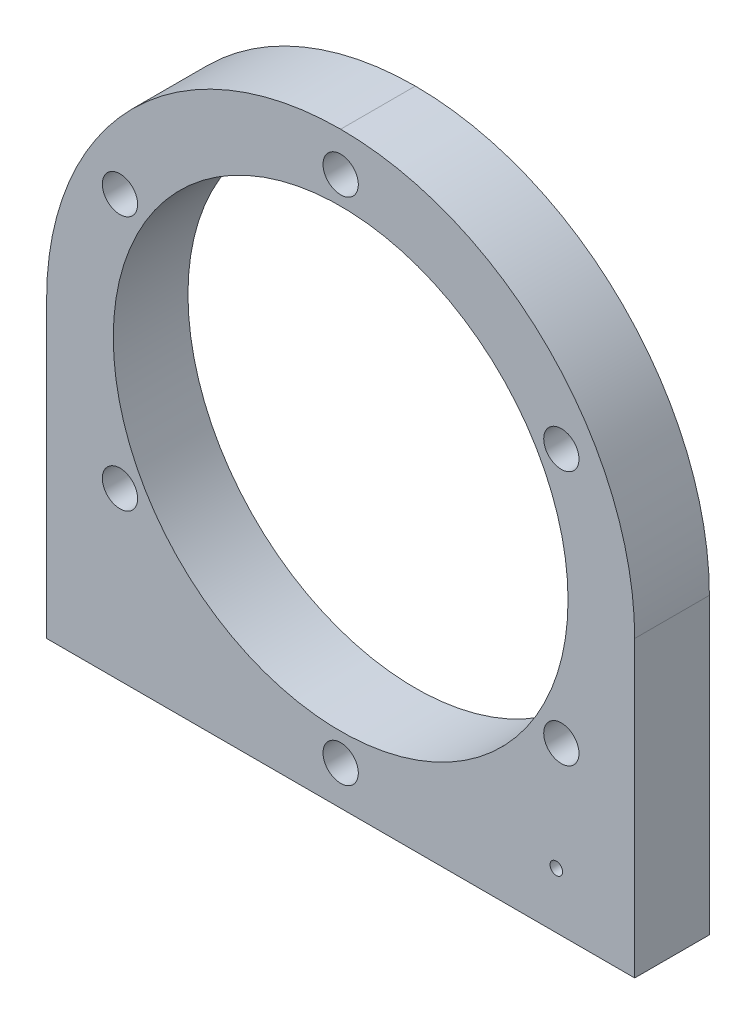
ISO-10303-21;
HEADER;
FILE_DESCRIPTION(('STEP AP214'),'2;1');
FILE_NAME('part.step','',(''),(''),'','','');
FILE_SCHEMA(('AUTOMOTIVE_DESIGN { 1 0 10303 214 1 1 1 1 }'));
ENDSEC;
DATA;
#1=APPLICATION_CONTEXT('core data for automotive mechanical design processes');
#2=APPLICATION_PROTOCOL_DEFINITION('international standard','automotive_design',2000,#1);
#3=PRODUCT_CONTEXT('',#1,'mechanical');
#4=PRODUCT('Part','Part','',(#3));
#5=PRODUCT_RELATED_PRODUCT_CATEGORY('part','',(#4));
#6=PRODUCT_DEFINITION_FORMATION('','',#4);
#7=PRODUCT_DEFINITION_CONTEXT('part definition',#1,'design');
#8=PRODUCT_DEFINITION('design','',#6,#7);
#9=PRODUCT_DEFINITION_SHAPE('','',#8);
#10=(LENGTH_UNIT() NAMED_UNIT(*) SI_UNIT(.MILLI.,.METRE.));
#11=(NAMED_UNIT(*) PLANE_ANGLE_UNIT() SI_UNIT($,.RADIAN.));
#12=(NAMED_UNIT(*) SI_UNIT($,.STERADIAN.) SOLID_ANGLE_UNIT());
#13=UNCERTAINTY_MEASURE_WITH_UNIT(LENGTH_MEASURE(1.E-05),#10,'distance_accuracy_value','');
#14=(GEOMETRIC_REPRESENTATION_CONTEXT(3) GLOBAL_UNCERTAINTY_ASSIGNED_CONTEXT((#13)) GLOBAL_UNIT_ASSIGNED_CONTEXT((#10,
#11,#12)) REPRESENTATION_CONTEXT('',''));
#15=CARTESIAN_POINT('',(0.,0.,0.));
#16=DIRECTION('',(0.,0.,1.));
#17=DIRECTION('',(1.,0.,0.));
#18=AXIS2_PLACEMENT_3D('',#15,#16,#17);
#19=CARTESIAN_POINT('',(-37.5,-37.5,4.7625));
#20=DIRECTION('',(1.,0.,0.));
#21=DIRECTION('',(0.,0.,-1.));
#22=AXIS2_PLACEMENT_3D('',#19,#20,#21);
#23=PLANE('',#22);
#24=DIRECTION('',(0.,-1.,0.));
#25=VECTOR('',#24,1.);
#26=CARTESIAN_POINT('',(-37.5,-37.5,4.7625));
#27=LINE('',#26,#25);
#28=CARTESIAN_POINT('',(-37.5,0.,4.7625));
#29=VERTEX_POINT('',#28);
#30=CARTESIAN_POINT('',(-37.5,-37.5,4.7625));
#31=VERTEX_POINT('',#30);
#32=EDGE_CURVE('E145',#29,#31,#27,.T.);
#33=ORIENTED_EDGE('',*,*,#32,.F.);
#34=DIRECTION('',(0.,0.,-1.));
#35=VECTOR('',#34,1.);
#36=CARTESIAN_POINT('',(-37.5,0.,4.7625));
#37=LINE('',#36,#35);
#38=CARTESIAN_POINT('',(-37.5,0.,-4.7625));
#39=VERTEX_POINT('',#38);
#40=EDGE_CURVE('E162',#29,#39,#37,.T.);
#41=ORIENTED_EDGE('',*,*,#40,.T.);
#42=DIRECTION('',(0.,-1.,0.));
#43=VECTOR('',#42,1.);
#44=CARTESIAN_POINT('',(-37.5,-37.5,-4.7625));
#45=LINE('',#44,#43);
#46=CARTESIAN_POINT('',(-37.5,-37.5,-4.7625));
#47=VERTEX_POINT('',#46);
#48=EDGE_CURVE('E144',#39,#47,#45,.T.);
#49=ORIENTED_EDGE('',*,*,#48,.T.);
#50=DIRECTION('',(0.,0.,-1.));
#51=VECTOR('',#50,1.);
#52=CARTESIAN_POINT('',(-37.5,-37.5,4.7625));
#53=LINE('',#52,#51);
#54=EDGE_CURVE('E159',#31,#47,#53,.T.);
#55=ORIENTED_EDGE('',*,*,#54,.F.);
#56=EDGE_LOOP('',(#33,#41,#49,#55));
#57=FACE_BOUND('',#56,.T.);
#58=ADVANCED_FACE('F51',(#57),#23,.F.);
#59=CARTESIAN_POINT('',(37.5,-37.5,4.7625));
#60=DIRECTION('',(0.,1.,0.));
#61=DIRECTION('',(-1.,0.,0.));
#62=AXIS2_PLACEMENT_3D('',#59,#60,#61);
#63=PLANE('',#62);
#64=CARTESIAN_POINT('',(32.5,-37.5,0.));
#65=DIRECTION('',(0.,-1.,0.));
#66=DIRECTION('',(0.,0.,-1.));
#67=AXIS2_PLACEMENT_3D('',#64,#65,#66);
#68=CIRCLE('',#67,1.64999999999999);
#69=CARTESIAN_POINT('',(32.5,-37.5,-1.65));
#70=VERTEX_POINT('',#69);
#71=EDGE_CURVE('E120',#70,#70,#68,.T.);
#72=ORIENTED_EDGE('',*,*,#71,.F.);
#73=EDGE_LOOP('',(#72));
#74=FACE_BOUND('',#73,.T.);
#75=CARTESIAN_POINT('',(22.5,-37.5,0.));
#76=DIRECTION('',(0.,-1.,0.));
#77=DIRECTION('',(0.,0.,-1.));
#78=AXIS2_PLACEMENT_3D('',#75,#76,#77);
#79=CIRCLE('',#78,1.64999999999999);
#80=CARTESIAN_POINT('',(22.5,-37.5,-1.64999999999999));
#81=VERTEX_POINT('',#80);
#82=EDGE_CURVE('E119',#81,#81,#79,.T.);
#83=ORIENTED_EDGE('',*,*,#82,.F.);
#84=EDGE_LOOP('',(#83));
#85=FACE_BOUND('',#84,.T.);
#86=CARTESIAN_POINT('',(-22.5,-37.5,0.));
#87=DIRECTION('',(0.,-1.,0.));
#88=DIRECTION('',(0.,0.,-1.));
#89=AXIS2_PLACEMENT_3D('',#86,#87,#88);
#90=CIRCLE('',#89,1.64999999999999);
#91=CARTESIAN_POINT('',(-22.5,-37.5,-1.64999999999999));
#92=VERTEX_POINT('',#91);
#93=EDGE_CURVE('E132',#92,#92,#90,.T.);
#94=ORIENTED_EDGE('',*,*,#93,.F.);
#95=EDGE_LOOP('',(#94));
#96=FACE_BOUND('',#95,.T.);
#97=CARTESIAN_POINT('',(-32.5,-37.5,0.));
#98=DIRECTION('',(0.,-1.,0.));
#99=DIRECTION('',(0.,0.,-1.));
#100=AXIS2_PLACEMENT_3D('',#97,#98,#99);
#101=CIRCLE('',#100,1.64999999999999);
#102=CARTESIAN_POINT('',(-32.5,-37.5,-1.64999999999999));
#103=VERTEX_POINT('',#102);
#104=EDGE_CURVE('E138',#103,#103,#101,.T.);
#105=ORIENTED_EDGE('',*,*,#104,.F.);
#106=EDGE_LOOP('',(#105));
#107=FACE_BOUND('',#106,.T.);
#108=DIRECTION('',(1.,0.,0.));
#109=VECTOR('',#108,1.);
#110=CARTESIAN_POINT('',(37.5,-37.5,-4.7625));
#111=LINE('',#110,#109);
#112=CARTESIAN_POINT('',(37.5,-37.5,-4.7625));
#113=VERTEX_POINT('',#112);
#114=EDGE_CURVE('E154',#47,#113,#111,.T.);
#115=ORIENTED_EDGE('',*,*,#114,.T.);
#116=DIRECTION('',(0.,0.,-1.));
#117=VECTOR('',#116,1.);
#118=CARTESIAN_POINT('',(37.5,-37.5,4.7625));
#119=LINE('',#118,#117);
#120=CARTESIAN_POINT('',(37.5,-37.5,4.7625));
#121=VERTEX_POINT('',#120);
#122=EDGE_CURVE('E152',#121,#113,#119,.T.);
#123=ORIENTED_EDGE('',*,*,#122,.F.);
#124=DIRECTION('',(1.,0.,0.));
#125=VECTOR('',#124,1.);
#126=CARTESIAN_POINT('',(37.5,-37.5,4.7625));
#127=LINE('',#126,#125);
#128=EDGE_CURVE('E147',#31,#121,#127,.T.);
#129=ORIENTED_EDGE('',*,*,#128,.F.);
#130=ORIENTED_EDGE('',*,*,#54,.T.);
#131=EDGE_LOOP('',(#115,#123,#129,#130));
#132=FACE_BOUND('',#131,.T.);
#133=ADVANCED_FACE('F250',(#74,#85,#96,#107,#132),#63,.F.);
#134=CARTESIAN_POINT('',(37.5,-37.5,4.7625));
#135=DIRECTION('',(-1.,0.,0.));
#136=DIRECTION('',(0.,0.,1.));
#137=AXIS2_PLACEMENT_3D('',#134,#135,#136);
#138=PLANE('',#137);
#139=DIRECTION('',(0.,1.,0.));
#140=VECTOR('',#139,1.);
#141=CARTESIAN_POINT('',(37.5,-37.5,-4.7625));
#142=LINE('',#141,#140);
#143=CARTESIAN_POINT('',(37.5,0.,-4.7625));
#144=VERTEX_POINT('',#143);
#145=EDGE_CURVE('E148',#113,#144,#142,.T.);
#146=ORIENTED_EDGE('',*,*,#145,.T.);
#147=DIRECTION('',(0.,0.,-1.));
#148=VECTOR('',#147,1.);
#149=CARTESIAN_POINT('',(37.5,0.,4.7625));
#150=LINE('',#149,#148);
#151=CARTESIAN_POINT('',(37.5,0.,4.7625));
#152=VERTEX_POINT('',#151);
#153=EDGE_CURVE('E11',#144,#152,#150,.F.);
#154=ORIENTED_EDGE('',*,*,#153,.T.);
#155=DIRECTION('',(0.,1.,0.));
#156=VECTOR('',#155,1.);
#157=CARTESIAN_POINT('',(37.5,-37.5,4.7625));
#158=LINE('',#157,#156);
#159=EDGE_CURVE('E150',#121,#152,#158,.T.);
#160=ORIENTED_EDGE('',*,*,#159,.F.);
#161=ORIENTED_EDGE('',*,*,#122,.T.);
#162=EDGE_LOOP('',(#146,#154,#160,#161));
#163=FACE_BOUND('',#162,.T.);
#164=ADVANCED_FACE('F240',(#163),#138,.F.);
#165=CARTESIAN_POINT('',(0.,0.,4.7625));
#166=DIRECTION('',(0.,0.,1.));
#167=DIRECTION('',(1.,0.,0.));
#168=AXIS2_PLACEMENT_3D('',#165,#166,#167);
#169=PLANE('',#168);
#170=CARTESIAN_POINT('',(27.5,-30.38125,4.7625));
#171=DIRECTION('',(0.,0.,1.));
#172=DIRECTION('',(1.,0.,0.));
#173=AXIS2_PLACEMENT_3D('',#170,#171,#172);
#174=CIRCLE('',#173,0.799999999999988);
#175=CARTESIAN_POINT('',(28.3,-30.38125,4.7625));
#176=VERTEX_POINT('',#175);
#177=EDGE_CURVE('E193',#176,#176,#174,.T.);
#178=ORIENTED_EDGE('',*,*,#177,.F.);
#179=EDGE_LOOP('',(#178));
#180=FACE_BOUND('',#179,.T.);
#181=CARTESIAN_POINT('',(0.,32.5,4.7625));
#182=DIRECTION('',(0.,0.,-1.));
#183=DIRECTION('',(-1.,0.,0.));
#184=AXIS2_PLACEMENT_3D('',#181,#182,#183);
#185=CIRCLE('',#184,2.25);
#186=CARTESIAN_POINT('',(-2.25,32.5,4.7625));
#187=VERTEX_POINT('',#186);
#188=EDGE_CURVE('E190',#187,#187,#185,.T.);
#189=ORIENTED_EDGE('',*,*,#188,.T.);
#190=EDGE_LOOP('',(#189));
#191=FACE_BOUND('',#190,.T.);
#192=CARTESIAN_POINT('',(-28.1458256229944,16.2499999999998,4.7625));
#193=DIRECTION('',(0.,0.,-1.));
#194=DIRECTION('',(-1.,0.,0.));
#195=AXIS2_PLACEMENT_3D('',#192,#193,#194);
#196=CIRCLE('',#195,2.25);
#197=CARTESIAN_POINT('',(-30.3958256229944,16.2499999999998,4.7625));
#198=VERTEX_POINT('',#197);
#199=EDGE_CURVE('E205',#198,#198,#196,.T.);
#200=ORIENTED_EDGE('',*,*,#199,.T.);
#201=EDGE_LOOP('',(#200));
#202=FACE_BOUND('',#201,.T.);
#203=CARTESIAN_POINT('',(28.1458256229942,16.25,4.7625));
#204=DIRECTION('',(0.,0.,-1.));
#205=DIRECTION('',(-1.,0.,0.));
#206=AXIS2_PLACEMENT_3D('',#203,#204,#205);
#207=CIRCLE('',#206,2.25);
#208=CARTESIAN_POINT('',(25.8958256229942,16.25,4.7625));
#209=VERTEX_POINT('',#208);
#210=EDGE_CURVE('E211',#209,#209,#207,.T.);
#211=ORIENTED_EDGE('',*,*,#210,.T.);
#212=EDGE_LOOP('',(#211));
#213=FACE_BOUND('',#212,.T.);
#214=CARTESIAN_POINT('',(28.1458256229943,-16.25,4.7625));
#215=DIRECTION('',(0.,0.,-1.));
#216=DIRECTION('',(-1.,0.,0.));
#217=AXIS2_PLACEMENT_3D('',#214,#215,#216);
#218=CIRCLE('',#217,2.25);
#219=CARTESIAN_POINT('',(25.8958256229943,-16.25,4.7625));
#220=VERTEX_POINT('',#219);
#221=EDGE_CURVE('E217',#220,#220,#218,.T.);
#222=ORIENTED_EDGE('',*,*,#221,.T.);
#223=EDGE_LOOP('',(#222));
#224=FACE_BOUND('',#223,.T.);
#225=CARTESIAN_POINT('',(0.,-32.5,4.7625));
#226=DIRECTION('',(0.,0.,-1.));
#227=DIRECTION('',(-1.,0.,0.));
#228=AXIS2_PLACEMENT_3D('',#225,#226,#227);
#229=CIRCLE('',#228,2.25);
#230=CARTESIAN_POINT('',(-2.25,-32.5,4.7625));
#231=VERTEX_POINT('',#230);
#232=EDGE_CURVE('E223',#231,#231,#229,.T.);
#233=ORIENTED_EDGE('',*,*,#232,.T.);
#234=EDGE_LOOP('',(#233));
#235=FACE_BOUND('',#234,.T.);
#236=CARTESIAN_POINT('',(-28.1458256229941,-16.2500000000003,4.7625));
#237=DIRECTION('',(0.,0.,-1.));
#238=DIRECTION('',(-1.,0.,0.));
#239=AXIS2_PLACEMENT_3D('',#236,#237,#238);
#240=CIRCLE('',#239,2.25);
#241=CARTESIAN_POINT('',(-30.3958256229941,-16.2500000000003,4.7625));
#242=VERTEX_POINT('',#241);
#243=EDGE_CURVE('E229',#242,#242,#240,.T.);
#244=ORIENTED_EDGE('',*,*,#243,.T.);
#245=EDGE_LOOP('',(#244));
#246=FACE_BOUND('',#245,.T.);
#247=CARTESIAN_POINT('',(0.,0.,4.7625));
#248=DIRECTION('',(0.,0.,1.));
#249=DIRECTION('',(1.,0.,0.));
#250=AXIS2_PLACEMENT_3D('',#247,#248,#249);
#251=CIRCLE('',#250,29.);
#252=CARTESIAN_POINT('',(29.,0.,4.7625));
#253=VERTEX_POINT('',#252);
#254=EDGE_CURVE('E232',#253,#253,#251,.T.);
#255=ORIENTED_EDGE('',*,*,#254,.F.);
#256=EDGE_LOOP('',(#255));
#257=FACE_BOUND('',#256,.T.);
#258=CARTESIAN_POINT('',(0.,0.,4.7625));
#259=DIRECTION('',(0.,0.,1.));
#260=DIRECTION('',(1.,0.,0.));
#261=AXIS2_PLACEMENT_3D('',#258,#259,#260);
#262=CIRCLE('',#261,37.5);
#263=CARTESIAN_POINT('',(0.,37.5,4.7625));
#264=VERTEX_POINT('',#263);
#265=EDGE_CURVE('E67',#152,#264,#262,.T.);
#266=ORIENTED_EDGE('',*,*,#265,.T.);
#267=CARTESIAN_POINT('',(0.,0.,4.7625));
#268=DIRECTION('',(0.,0.,1.));
#269=DIRECTION('',(1.,0.,0.));
#270=AXIS2_PLACEMENT_3D('',#267,#268,#269);
#271=CIRCLE('',#270,37.5);
#272=EDGE_CURVE('E60',#264,#29,#271,.T.);
#273=ORIENTED_EDGE('',*,*,#272,.T.);
#274=ORIENTED_EDGE('',*,*,#32,.T.);
#275=ORIENTED_EDGE('',*,*,#128,.T.);
#276=ORIENTED_EDGE('',*,*,#159,.T.);
#277=EDGE_LOOP('',(#266,#273,#274,#275,#276));
#278=FACE_BOUND('',#277,.T.);
#279=ADVANCED_FACE('F172',(#180,#191,#202,#213,#224,#235,#246,#257,#278),#169,.T.);
#280=CARTESIAN_POINT('',(0.,0.,-4.7625));
#281=DIRECTION('',(0.,0.,1.));
#282=DIRECTION('',(1.,0.,0.));
#283=AXIS2_PLACEMENT_3D('',#280,#281,#282);
#284=PLANE('',#283);
#285=CARTESIAN_POINT('',(27.5,-30.38125,-4.7625));
#286=DIRECTION('',(0.,0.,1.));
#287=DIRECTION('',(1.,0.,0.));
#288=AXIS2_PLACEMENT_3D('',#285,#286,#287);
#289=CIRCLE('',#288,0.799999999999999);
#290=CARTESIAN_POINT('',(28.3,-30.38125,-4.7625));
#291=VERTEX_POINT('',#290);
#292=EDGE_CURVE('E188',#291,#291,#289,.T.);
#293=ORIENTED_EDGE('',*,*,#292,.T.);
#294=EDGE_LOOP('',(#293));
#295=FACE_BOUND('',#294,.T.);
#296=CARTESIAN_POINT('',(0.,32.5,-4.7625));
#297=DIRECTION('',(0.,0.,-1.));
#298=DIRECTION('',(-1.,0.,0.));
#299=AXIS2_PLACEMENT_3D('',#296,#297,#298);
#300=CIRCLE('',#299,2.24999999999999);
#301=CARTESIAN_POINT('',(-2.24999999999999,32.5,-4.7625));
#302=VERTEX_POINT('',#301);
#303=EDGE_CURVE('E187',#302,#302,#300,.T.);
#304=ORIENTED_EDGE('',*,*,#303,.F.);
#305=EDGE_LOOP('',(#304));
#306=FACE_BOUND('',#305,.T.);
#307=CARTESIAN_POINT('',(-28.1458256229944,16.2499999999998,-4.7625));
#308=DIRECTION('',(0.,0.,-1.));
#309=DIRECTION('',(-1.,0.,0.));
#310=AXIS2_PLACEMENT_3D('',#307,#308,#309);
#311=CIRCLE('',#310,2.24999999999999);
#312=CARTESIAN_POINT('',(-30.3958256229944,16.2499999999998,-4.7625));
#313=VERTEX_POINT('',#312);
#314=EDGE_CURVE('E202',#313,#313,#311,.T.);
#315=ORIENTED_EDGE('',*,*,#314,.F.);
#316=EDGE_LOOP('',(#315));
#317=FACE_BOUND('',#316,.T.);
#318=CARTESIAN_POINT('',(28.1458256229942,16.25,-4.7625));
#319=DIRECTION('',(0.,0.,-1.));
#320=DIRECTION('',(-1.,0.,0.));
#321=AXIS2_PLACEMENT_3D('',#318,#319,#320);
#322=CIRCLE('',#321,2.24999999999999);
#323=CARTESIAN_POINT('',(25.8958256229942,16.25,-4.7625));
#324=VERTEX_POINT('',#323);
#325=EDGE_CURVE('E208',#324,#324,#322,.T.);
#326=ORIENTED_EDGE('',*,*,#325,.F.);
#327=EDGE_LOOP('',(#326));
#328=FACE_BOUND('',#327,.T.);
#329=CARTESIAN_POINT('',(28.1458256229943,-16.25,-4.7625));
#330=DIRECTION('',(0.,0.,-1.));
#331=DIRECTION('',(-1.,0.,0.));
#332=AXIS2_PLACEMENT_3D('',#329,#330,#331);
#333=CIRCLE('',#332,2.24999999999999);
#334=CARTESIAN_POINT('',(25.8958256229943,-16.25,-4.7625));
#335=VERTEX_POINT('',#334);
#336=EDGE_CURVE('E214',#335,#335,#333,.T.);
#337=ORIENTED_EDGE('',*,*,#336,.F.);
#338=EDGE_LOOP('',(#337));
#339=FACE_BOUND('',#338,.T.);
#340=CARTESIAN_POINT('',(0.,-32.5,-4.7625));
#341=DIRECTION('',(0.,0.,-1.));
#342=DIRECTION('',(-1.,0.,0.));
#343=AXIS2_PLACEMENT_3D('',#340,#341,#342);
#344=CIRCLE('',#343,2.24999999999999);
#345=CARTESIAN_POINT('',(-2.24999999999999,-32.5,-4.7625));
#346=VERTEX_POINT('',#345);
#347=EDGE_CURVE('E220',#346,#346,#344,.T.);
#348=ORIENTED_EDGE('',*,*,#347,.F.);
#349=EDGE_LOOP('',(#348));
#350=FACE_BOUND('',#349,.T.);
#351=CARTESIAN_POINT('',(-28.1458256229941,-16.2500000000003,-4.7625));
#352=DIRECTION('',(0.,0.,-1.));
#353=DIRECTION('',(-1.,0.,0.));
#354=AXIS2_PLACEMENT_3D('',#351,#352,#353);
#355=CIRCLE('',#354,2.24999999999999);
#356=CARTESIAN_POINT('',(-30.395825622994,-16.2500000000003,-4.7625));
#357=VERTEX_POINT('',#356);
#358=EDGE_CURVE('E226',#357,#357,#355,.T.);
#359=ORIENTED_EDGE('',*,*,#358,.F.);
#360=EDGE_LOOP('',(#359));
#361=FACE_BOUND('',#360,.T.);
#362=CARTESIAN_POINT('',(0.,0.,-4.7625));
#363=DIRECTION('',(0.,0.,1.));
#364=DIRECTION('',(1.,0.,0.));
#365=AXIS2_PLACEMENT_3D('',#362,#363,#364);
#366=CIRCLE('',#365,29.);
#367=CARTESIAN_POINT('',(29.,0.,-4.7625));
#368=VERTEX_POINT('',#367);
#369=EDGE_CURVE('E126',#368,#368,#366,.T.);
#370=ORIENTED_EDGE('',*,*,#369,.T.);
#371=EDGE_LOOP('',(#370));
#372=FACE_BOUND('',#371,.T.);
#373=ORIENTED_EDGE('',*,*,#48,.F.);
#374=CARTESIAN_POINT('',(0.,0.,-4.7625));
#375=DIRECTION('',(0.,0.,1.));
#376=DIRECTION('',(1.,0.,0.));
#377=AXIS2_PLACEMENT_3D('',#374,#375,#376);
#378=CIRCLE('',#377,37.5);
#379=CARTESIAN_POINT('',(0.,37.5,-4.7625));
#380=VERTEX_POINT('',#379);
#381=EDGE_CURVE('E167',#39,#380,#378,.F.);
#382=ORIENTED_EDGE('',*,*,#381,.T.);
#383=CARTESIAN_POINT('',(0.,0.,-4.7625));
#384=DIRECTION('',(0.,0.,1.));
#385=DIRECTION('',(1.,0.,0.));
#386=AXIS2_PLACEMENT_3D('',#383,#384,#385);
#387=CIRCLE('',#386,37.5);
#388=EDGE_CURVE('E165',#380,#144,#387,.F.);
#389=ORIENTED_EDGE('',*,*,#388,.T.);
#390=ORIENTED_EDGE('',*,*,#145,.F.);
#391=ORIENTED_EDGE('',*,*,#114,.F.);
#392=EDGE_LOOP('',(#373,#382,#389,#390,#391));
#393=FACE_BOUND('',#392,.T.);
#394=ADVANCED_FACE('F183',(#295,#306,#317,#328,#339,#350,#361,#372,#393),#284,.F.);
#395=CARTESIAN_POINT('',(-32.5,-22.5,0.));
#396=DIRECTION('',(0.,-1.,0.));
#397=DIRECTION('',(0.,0.,-1.));
#398=AXIS2_PLACEMENT_3D('',#395,#396,#397);
#399=CONICAL_SURFACE('',#398,1.65,1.02974425867665);
#400=CARTESIAN_POINT('',(-32.5,-21.5085799786045,0.));
#401=VERTEX_POINT('',#400);
#402=VERTEX_LOOP('',#401);
#403=FACE_BOUND('',#402,.T.);
#404=CARTESIAN_POINT('',(-32.5,-22.5,0.));
#405=DIRECTION('',(0.,-1.,0.));
#406=DIRECTION('',(0.,0.,-1.));
#407=AXIS2_PLACEMENT_3D('',#404,#405,#406);
#408=CIRCLE('',#407,1.65);
#409=CARTESIAN_POINT('',(-32.5,-22.5,-1.64999999999999));
#410=VERTEX_POINT('',#409);
#411=EDGE_CURVE('E141',#410,#410,#408,.T.);
#412=ORIENTED_EDGE('',*,*,#411,.T.);
#413=EDGE_LOOP('',(#412));
#414=FACE_BOUND('',#413,.T.);
#415=ADVANCED_FACE('F247',(#403,#414),#399,.F.);
#416=CARTESIAN_POINT('',(-32.5,-37.5,0.));
#417=DIRECTION('',(0.,-1.,0.));
#418=DIRECTION('',(0.,0.,-1.));
#419=AXIS2_PLACEMENT_3D('',#416,#417,#418);
#420=CYLINDRICAL_SURFACE('',#419,1.64999999999999);
#421=ORIENTED_EDGE('',*,*,#411,.F.);
#422=EDGE_LOOP('',(#421));
#423=FACE_BOUND('',#422,.T.);
#424=ORIENTED_EDGE('',*,*,#104,.T.);
#425=EDGE_LOOP('',(#424));
#426=FACE_BOUND('',#425,.T.);
#427=ADVANCED_FACE('F320',(#423,#426),#420,.F.);
#428=CARTESIAN_POINT('',(-22.5,-22.5,0.));
#429=DIRECTION('',(0.,-1.,0.));
#430=DIRECTION('',(0.,0.,-1.));
#431=AXIS2_PLACEMENT_3D('',#428,#429,#430);
#432=CONICAL_SURFACE('',#431,1.65,1.02974425867665);
#433=CARTESIAN_POINT('',(-22.5,-21.5085799786045,0.));
#434=VERTEX_POINT('',#433);
#435=VERTEX_LOOP('',#434);
#436=FACE_BOUND('',#435,.T.);
#437=CARTESIAN_POINT('',(-22.5,-22.5,0.));
#438=DIRECTION('',(0.,-1.,0.));
#439=DIRECTION('',(0.,0.,-1.));
#440=AXIS2_PLACEMENT_3D('',#437,#438,#439);
#441=CIRCLE('',#440,1.65);
#442=CARTESIAN_POINT('',(-22.5,-22.5,-1.64999999999999));
#443=VERTEX_POINT('',#442);
#444=EDGE_CURVE('E135',#443,#443,#441,.T.);
#445=ORIENTED_EDGE('',*,*,#444,.T.);
#446=EDGE_LOOP('',(#445));
#447=FACE_BOUND('',#446,.T.);
#448=ADVANCED_FACE('F316',(#436,#447),#432,.F.);
#449=CARTESIAN_POINT('',(-22.5,-37.5,0.));
#450=DIRECTION('',(0.,-1.,0.));
#451=DIRECTION('',(0.,0.,-1.));
#452=AXIS2_PLACEMENT_3D('',#449,#450,#451);
#453=CYLINDRICAL_SURFACE('',#452,1.64999999999999);
#454=ORIENTED_EDGE('',*,*,#444,.F.);
#455=EDGE_LOOP('',(#454));
#456=FACE_BOUND('',#455,.T.);
#457=ORIENTED_EDGE('',*,*,#93,.T.);
#458=EDGE_LOOP('',(#457));
#459=FACE_BOUND('',#458,.T.);
#460=ADVANCED_FACE('F312',(#456,#459),#453,.F.);
#461=CARTESIAN_POINT('',(22.5,-22.5,0.));
#462=DIRECTION('',(0.,-1.,0.));
#463=DIRECTION('',(0.,0.,-1.));
#464=AXIS2_PLACEMENT_3D('',#461,#462,#463);
#465=CONICAL_SURFACE('',#464,1.65,1.02974425867665);
#466=CARTESIAN_POINT('',(22.5,-21.5085799786045,0.));
#467=VERTEX_POINT('',#466);
#468=VERTEX_LOOP('',#467);
#469=FACE_BOUND('',#468,.T.);
#470=CARTESIAN_POINT('',(22.5,-22.5,0.));
#471=DIRECTION('',(0.,-1.,0.));
#472=DIRECTION('',(0.,0.,-1.));
#473=AXIS2_PLACEMENT_3D('',#470,#471,#472);
#474=CIRCLE('',#473,1.65);
#475=CARTESIAN_POINT('',(22.5,-22.5,-1.65));
#476=VERTEX_POINT('',#475);
#477=EDGE_CURVE('E123',#476,#476,#474,.T.);
#478=ORIENTED_EDGE('',*,*,#477,.T.);
#479=EDGE_LOOP('',(#478));
#480=FACE_BOUND('',#479,.T.);
#481=ADVANCED_FACE('F308',(#469,#480),#465,.F.);
#482=CARTESIAN_POINT('',(22.5,-37.5,0.));
#483=DIRECTION('',(0.,-1.,0.));
#484=DIRECTION('',(0.,0.,-1.));
#485=AXIS2_PLACEMENT_3D('',#482,#483,#484);
#486=CYLINDRICAL_SURFACE('',#485,1.64999999999999);
#487=ORIENTED_EDGE('',*,*,#477,.F.);
#488=EDGE_LOOP('',(#487));
#489=FACE_BOUND('',#488,.T.);
#490=ORIENTED_EDGE('',*,*,#82,.T.);
#491=EDGE_LOOP('',(#490));
#492=FACE_BOUND('',#491,.T.);
#493=ADVANCED_FACE('F113',(#489,#492),#486,.F.);
#494=CARTESIAN_POINT('',(32.5,-22.5,0.));
#495=DIRECTION('',(0.,-1.,0.));
#496=DIRECTION('',(0.,0.,-1.));
#497=AXIS2_PLACEMENT_3D('',#494,#495,#496);
#498=CONICAL_SURFACE('',#497,1.65,1.02974425867665);
#499=CARTESIAN_POINT('',(32.5,-21.5085799786045,0.));
#500=VERTEX_POINT('',#499);
#501=VERTEX_LOOP('',#500);
#502=FACE_BOUND('',#501,.T.);
#503=CARTESIAN_POINT('',(32.5,-22.5,0.));
#504=DIRECTION('',(0.,-1.,0.));
#505=DIRECTION('',(0.,0.,-1.));
#506=AXIS2_PLACEMENT_3D('',#503,#504,#505);
#507=CIRCLE('',#506,1.65);
#508=CARTESIAN_POINT('',(32.5,-22.5,-1.65));
#509=VERTEX_POINT('',#508);
#510=EDGE_CURVE('E117',#509,#509,#507,.T.);
#511=ORIENTED_EDGE('',*,*,#510,.T.);
#512=EDGE_LOOP('',(#511));
#513=FACE_BOUND('',#512,.T.);
#514=ADVANCED_FACE('F109',(#502,#513),#498,.F.);
#515=CARTESIAN_POINT('',(32.5,-37.5,0.));
#516=DIRECTION('',(0.,-1.,0.));
#517=DIRECTION('',(0.,0.,-1.));
#518=AXIS2_PLACEMENT_3D('',#515,#516,#517);
#519=CYLINDRICAL_SURFACE('',#518,1.65);
#520=ORIENTED_EDGE('',*,*,#510,.F.);
#521=EDGE_LOOP('',(#520));
#522=FACE_BOUND('',#521,.T.);
#523=ORIENTED_EDGE('',*,*,#71,.T.);
#524=EDGE_LOOP('',(#523));
#525=FACE_BOUND('',#524,.T.);
#526=ADVANCED_FACE('F112',(#522,#525),#519,.F.);
#527=CARTESIAN_POINT('',(0.,0.,-4.7625));
#528=DIRECTION('',(0.,0.,1.));
#529=DIRECTION('',(1.,0.,0.));
#530=AXIS2_PLACEMENT_3D('',#527,#528,#529);
#531=CYLINDRICAL_SURFACE('',#530,29.);
#532=CARTESIAN_POINT('',(29.,0.,-4.7625));
#533=CARTESIAN_POINT('',(29.,0.,-4.66328125));
#534=CARTESIAN_POINT('',(29.,0.,-4.5640625));
#535=CARTESIAN_POINT('',(29.,0.,-4.365625));
#536=CARTESIAN_POINT('',(29.,0.,-4.26640625));
#537=CARTESIAN_POINT('',(29.,0.,-4.06796875));
#538=CARTESIAN_POINT('',(29.,0.,-3.96875));
#539=CARTESIAN_POINT('',(29.,0.,-3.7703125));
#540=CARTESIAN_POINT('',(29.,0.,-3.67109375));
#541=CARTESIAN_POINT('',(29.,0.,-3.47265625));
#542=CARTESIAN_POINT('',(29.,0.,-3.3734375));
#543=CARTESIAN_POINT('',(29.,0.,-3.175));
#544=CARTESIAN_POINT('',(29.,0.,-3.07578125));
#545=CARTESIAN_POINT('',(29.,0.,-2.87734375));
#546=CARTESIAN_POINT('',(29.,0.,-2.778125));
#547=CARTESIAN_POINT('',(29.,0.,-2.5796875));
#548=CARTESIAN_POINT('',(29.,0.,-2.48046875));
#549=CARTESIAN_POINT('',(29.,0.,-2.28203125));
#550=CARTESIAN_POINT('',(29.,0.,-2.1828125));
#551=CARTESIAN_POINT('',(29.,0.,-1.984375));
#552=CARTESIAN_POINT('',(29.,0.,-1.88515625));
#553=CARTESIAN_POINT('',(29.,0.,-1.68671875));
#554=CARTESIAN_POINT('',(29.,0.,-1.5875));
#555=CARTESIAN_POINT('',(29.,0.,-1.3890625));
#556=CARTESIAN_POINT('',(29.,0.,-1.28984375));
#557=CARTESIAN_POINT('',(29.,0.,-1.09140625));
#558=CARTESIAN_POINT('',(29.,0.,-0.9921875));
#559=CARTESIAN_POINT('',(29.,0.,-0.793750000000001));
#560=CARTESIAN_POINT('',(29.,0.,-0.694531250000001));
#561=CARTESIAN_POINT('',(29.,0.,-0.496093750000001));
#562=CARTESIAN_POINT('',(29.,0.,-0.396875000000001));
#563=CARTESIAN_POINT('',(29.,0.,-0.198437500000001));
#564=CARTESIAN_POINT('',(29.,0.,-0.0992187500000009));
#565=CARTESIAN_POINT('',(29.,0.,0.0992187499999992));
#566=CARTESIAN_POINT('',(29.,0.,0.198437499999999));
#567=CARTESIAN_POINT('',(29.,0.,0.396874999999999));
#568=CARTESIAN_POINT('',(29.,0.,0.496093749999999));
#569=CARTESIAN_POINT('',(29.,0.,0.694531249999999));
#570=CARTESIAN_POINT('',(29.,0.,0.79375));
#571=CARTESIAN_POINT('',(29.,0.,0.9921875));
#572=CARTESIAN_POINT('',(29.,0.,1.09140625));
#573=CARTESIAN_POINT('',(29.,0.,1.28984375));
#574=CARTESIAN_POINT('',(29.,0.,1.3890625));
#575=CARTESIAN_POINT('',(29.,0.,1.5875));
#576=CARTESIAN_POINT('',(29.,0.,1.68671875));
#577=CARTESIAN_POINT('',(29.,0.,1.88515625));
#578=CARTESIAN_POINT('',(29.,0.,1.984375));
#579=CARTESIAN_POINT('',(29.,0.,2.1828125));
#580=CARTESIAN_POINT('',(29.,0.,2.28203125));
#581=CARTESIAN_POINT('',(29.,0.,2.48046875));
#582=CARTESIAN_POINT('',(29.,0.,2.5796875));
#583=CARTESIAN_POINT('',(29.,0.,2.778125));
#584=CARTESIAN_POINT('',(29.,0.,2.87734375));
#585=CARTESIAN_POINT('',(29.,0.,3.07578125));
#586=CARTESIAN_POINT('',(29.,0.,3.175));
#587=CARTESIAN_POINT('',(29.,0.,3.3734375));
#588=CARTESIAN_POINT('',(29.,0.,3.47265625));
#589=CARTESIAN_POINT('',(29.,0.,3.67109375));
#590=CARTESIAN_POINT('',(29.,0.,3.7703125));
#591=CARTESIAN_POINT('',(29.,0.,3.96875));
#592=CARTESIAN_POINT('',(29.,0.,4.06796875));
#593=CARTESIAN_POINT('',(29.,0.,4.26640625));
#594=CARTESIAN_POINT('',(29.,0.,4.365625));
#595=CARTESIAN_POINT('',(29.,0.,4.5640625));
#596=CARTESIAN_POINT('',(29.,0.,4.66328125));
#597=CARTESIAN_POINT('',(29.,0.,4.7625));
#598=B_SPLINE_CURVE_WITH_KNOTS('',3,(#532,#533,#534,#535,#536,#537,#538,#539,#540,#541,#542,
#543,#544,#545,#546,#547,#548,#549,#550,#551,#552,#553,#554,#555,#556,#557,#558,#559,#560,#561,
#562,#563,#564,#565,#566,#567,#568,#569,#570,#571,#572,#573,#574,#575,#576,#577,#578,#579,#580,
#581,#582,#583,#584,#585,#586,#587,#588,#589,#590,#591,#592,#593,#594,#595,#596,#597),
.UNSPECIFIED.,.F.,.F.,(4,2,2,2,2,2,2,2,2,2,2,2,2,2,2,2,2,2,2,2,2,2,2,2,2,2,2,2,2,2,2,2,4),(0.,
0.29765625,0.5953125,0.892968750000001,1.190625,1.48828125,1.7859375,2.08359375,2.38125,
2.67890625,2.9765625,3.27421875,3.571875,3.86953125,4.1671875,4.46484375,4.7625,5.06015625,
5.3578125,5.65546875,5.953125,6.25078125,6.5484375,6.84609375,7.14375,7.44140625,7.7390625,
8.03671875,8.334375,8.63203125,8.9296875,9.22734375,9.525),.UNSPECIFIED.);
#599=EDGE_CURVE('BSEAM237',#368,#253,#598,.T.);
#600=ORIENTED_EDGE('',*,*,#369,.F.);
#601=ORIENTED_EDGE('',*,*,#254,.T.);
#602=ORIENTED_EDGE('',*,*,#599,.T.);
#603=ORIENTED_EDGE('',*,*,#599,.F.);
#604=EDGE_LOOP('',(#600,#602,#601,#603));
#605=FACE_BOUND('',#604,.T.);
#606=ADVANCED_FACE('F237',(#605),#531,.F.);
#607=CARTESIAN_POINT('',(-28.1458256229941,-16.2500000000003,-4.7625));
#608=DIRECTION('',(0.,0.,-1.));
#609=DIRECTION('',(-1.,0.,0.));
#610=AXIS2_PLACEMENT_3D('',#607,#608,#609);
#611=CYLINDRICAL_SURFACE('',#610,2.24999999999999);
#612=ORIENTED_EDGE('',*,*,#243,.F.);
#613=EDGE_LOOP('',(#612));
#614=FACE_BOUND('',#613,.T.);
#615=ORIENTED_EDGE('',*,*,#358,.T.);
#616=EDGE_LOOP('',(#615));
#617=FACE_BOUND('',#616,.T.);
#618=ADVANCED_FACE('F296',(#614,#617),#611,.F.);
#619=CARTESIAN_POINT('',(0.,-32.5,-4.7625));
#620=DIRECTION('',(0.,0.,-1.));
#621=DIRECTION('',(-1.,0.,0.));
#622=AXIS2_PLACEMENT_3D('',#619,#620,#621);
#623=CYLINDRICAL_SURFACE('',#622,2.24999999999999);
#624=ORIENTED_EDGE('',*,*,#232,.F.);
#625=EDGE_LOOP('',(#624));
#626=FACE_BOUND('',#625,.T.);
#627=ORIENTED_EDGE('',*,*,#347,.T.);
#628=EDGE_LOOP('',(#627));
#629=FACE_BOUND('',#628,.T.);
#630=ADVANCED_FACE('F292',(#626,#629),#623,.F.);
#631=CARTESIAN_POINT('',(28.1458256229943,-16.25,-4.7625));
#632=DIRECTION('',(0.,0.,-1.));
#633=DIRECTION('',(-1.,0.,0.));
#634=AXIS2_PLACEMENT_3D('',#631,#632,#633);
#635=CYLINDRICAL_SURFACE('',#634,2.24999999999999);
#636=ORIENTED_EDGE('',*,*,#221,.F.);
#637=EDGE_LOOP('',(#636));
#638=FACE_BOUND('',#637,.T.);
#639=ORIENTED_EDGE('',*,*,#336,.T.);
#640=EDGE_LOOP('',(#639));
#641=FACE_BOUND('',#640,.T.);
#642=ADVANCED_FACE('F288',(#638,#641),#635,.F.);
#643=CARTESIAN_POINT('',(28.1458256229942,16.25,-4.7625));
#644=DIRECTION('',(0.,0.,-1.));
#645=DIRECTION('',(-1.,0.,0.));
#646=AXIS2_PLACEMENT_3D('',#643,#644,#645);
#647=CYLINDRICAL_SURFACE('',#646,2.24999999999999);
#648=ORIENTED_EDGE('',*,*,#210,.F.);
#649=EDGE_LOOP('',(#648));
#650=FACE_BOUND('',#649,.T.);
#651=ORIENTED_EDGE('',*,*,#325,.T.);
#652=EDGE_LOOP('',(#651));
#653=FACE_BOUND('',#652,.T.);
#654=ADVANCED_FACE('F280',(#650,#653),#647,.F.);
#655=CARTESIAN_POINT('',(-28.1458256229944,16.2499999999998,-4.7625));
#656=DIRECTION('',(0.,0.,-1.));
#657=DIRECTION('',(-1.,0.,0.));
#658=AXIS2_PLACEMENT_3D('',#655,#656,#657);
#659=CYLINDRICAL_SURFACE('',#658,2.24999999999999);
#660=ORIENTED_EDGE('',*,*,#199,.F.);
#661=EDGE_LOOP('',(#660));
#662=FACE_BOUND('',#661,.T.);
#663=ORIENTED_EDGE('',*,*,#314,.T.);
#664=EDGE_LOOP('',(#663));
#665=FACE_BOUND('',#664,.T.);
#666=ADVANCED_FACE('F274',(#662,#665),#659,.F.);
#667=CARTESIAN_POINT('',(0.,32.5,-4.7625));
#668=DIRECTION('',(0.,0.,-1.));
#669=DIRECTION('',(-1.,0.,0.));
#670=AXIS2_PLACEMENT_3D('',#667,#668,#669);
#671=CYLINDRICAL_SURFACE('',#670,2.24999999999999);
#672=ORIENTED_EDGE('',*,*,#188,.F.);
#673=EDGE_LOOP('',(#672));
#674=FACE_BOUND('',#673,.T.);
#675=ORIENTED_EDGE('',*,*,#303,.T.);
#676=EDGE_LOOP('',(#675));
#677=FACE_BOUND('',#676,.T.);
#678=ADVANCED_FACE('F271',(#674,#677),#671,.F.);
#679=CARTESIAN_POINT('',(0.,0.,4.7625));
#680=DIRECTION('',(0.,0.,-1.));
#681=DIRECTION('',(-1.,0.,0.));
#682=AXIS2_PLACEMENT_3D('',#679,#680,#681);
#683=CYLINDRICAL_SURFACE('',#682,37.5);
#684=DIRECTION('',(0.,0.,-1.));
#685=VECTOR('',#684,1.);
#686=CARTESIAN_POINT('',(0.,37.5,4.7625));
#687=LINE('',#686,#685);
#688=EDGE_CURVE('E55',#264,#380,#687,.T.);
#689=ORIENTED_EDGE('',*,*,#688,.F.);
#690=ORIENTED_EDGE('',*,*,#265,.F.);
#691=ORIENTED_EDGE('',*,*,#153,.F.);
#692=ORIENTED_EDGE('',*,*,#388,.F.);
#693=EDGE_LOOP('',(#689,#690,#691,#692));
#694=FACE_BOUND('',#693,.T.);
#695=ADVANCED_FACE('F53',(#694),#683,.T.);
#696=CARTESIAN_POINT('',(0.,0.,4.7625));
#697=DIRECTION('',(0.,0.,-1.));
#698=DIRECTION('',(-1.,0.,0.));
#699=AXIS2_PLACEMENT_3D('',#696,#697,#698);
#700=CYLINDRICAL_SURFACE('',#699,37.5);
#701=ORIENTED_EDGE('',*,*,#272,.F.);
#702=ORIENTED_EDGE('',*,*,#688,.T.);
#703=ORIENTED_EDGE('',*,*,#381,.F.);
#704=ORIENTED_EDGE('',*,*,#40,.F.);
#705=EDGE_LOOP('',(#701,#702,#703,#704));
#706=FACE_BOUND('',#705,.T.);
#707=ADVANCED_FACE('F180',(#706),#700,.T.);
#708=CARTESIAN_POINT('',(27.5,-30.38125,4.7625));
#709=DIRECTION('',(0.,0.,1.));
#710=DIRECTION('',(1.,0.,0.));
#711=AXIS2_PLACEMENT_3D('',#708,#709,#710);
#712=CYLINDRICAL_SURFACE('',#711,0.799999999999993);
#713=ORIENTED_EDGE('',*,*,#292,.F.);
#714=EDGE_LOOP('',(#713));
#715=FACE_BOUND('',#714,.T.);
#716=ORIENTED_EDGE('',*,*,#177,.T.);
#717=EDGE_LOOP('',(#716));
#718=FACE_BOUND('',#717,.T.);
#719=ADVANCED_FACE('F264',(#715,#718),#712,.F.);
#720=CLOSED_SHELL('',(#58,#133,#164,#279,#394,#415,#427,#448,#460,#481,#493,#514,#526,#606,#618,
#630,#642,#654,#666,#678,#695,#707,#719));
#721=MANIFOLD_SOLID_BREP('B2',#720);
#722=ADVANCED_BREP_SHAPE_REPRESENTATION('',(#18,#721),#14);
#723=SHAPE_DEFINITION_REPRESENTATION(#9,#722);
ENDSEC;
END-ISO-10303-21;
